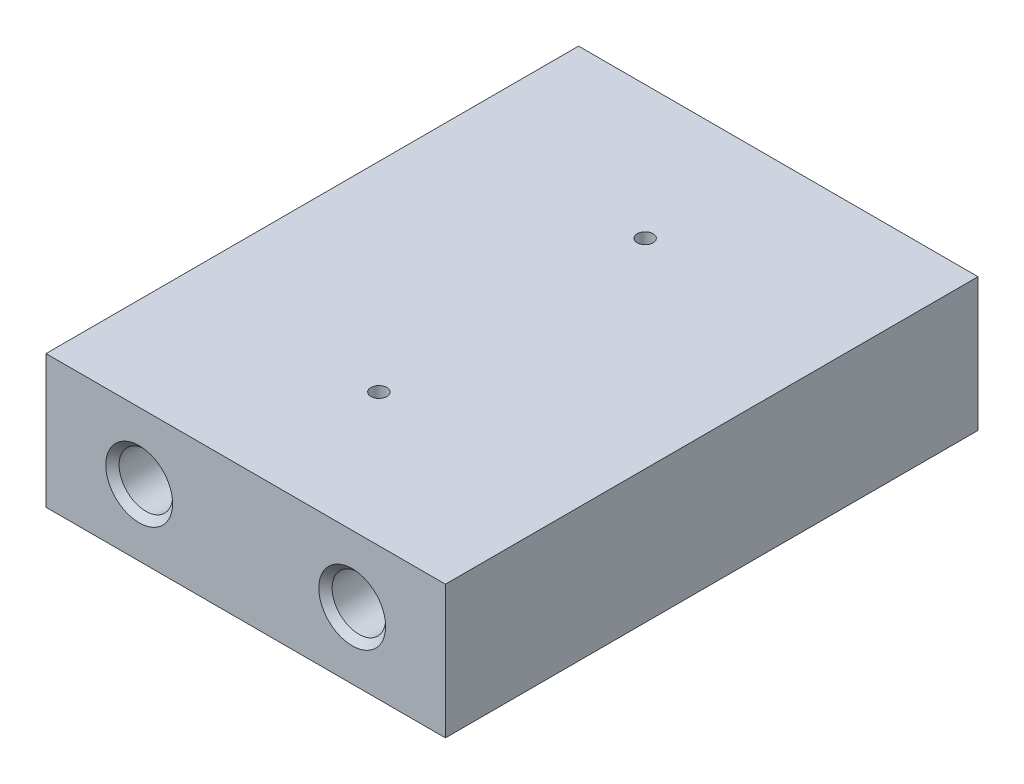
ISO-10303-21;
HEADER;
FILE_DESCRIPTION(('STEP AP214'),'2;1');
FILE_NAME('part.step','',(''),(''),'','','');
FILE_SCHEMA(('AUTOMOTIVE_DESIGN { 1 0 10303 214 1 1 1 1 }'));
ENDSEC;
DATA;
#1=APPLICATION_CONTEXT('core data for automotive mechanical design processes');
#2=APPLICATION_PROTOCOL_DEFINITION('international standard','automotive_design',2000,#1);
#3=PRODUCT_CONTEXT('',#1,'mechanical');
#4=PRODUCT('Part','Part','',(#3));
#5=PRODUCT_RELATED_PRODUCT_CATEGORY('part','',(#4));
#6=PRODUCT_DEFINITION_FORMATION('','',#4);
#7=PRODUCT_DEFINITION_CONTEXT('part definition',#1,'design');
#8=PRODUCT_DEFINITION('design','',#6,#7);
#9=PRODUCT_DEFINITION_SHAPE('','',#8);
#10=(LENGTH_UNIT() NAMED_UNIT(*) SI_UNIT(.MILLI.,.METRE.));
#11=(NAMED_UNIT(*) PLANE_ANGLE_UNIT() SI_UNIT($,.RADIAN.));
#12=(NAMED_UNIT(*) SI_UNIT($,.STERADIAN.) SOLID_ANGLE_UNIT());
#13=UNCERTAINTY_MEASURE_WITH_UNIT(LENGTH_MEASURE(1.E-05),#10,'distance_accuracy_value','');
#14=(GEOMETRIC_REPRESENTATION_CONTEXT(3) GLOBAL_UNCERTAINTY_ASSIGNED_CONTEXT((#13)) GLOBAL_UNIT_ASSIGNED_CONTEXT((#10,
#11,#12)) REPRESENTATION_CONTEXT('',''));
#15=CARTESIAN_POINT('',(0.,0.,0.));
#16=DIRECTION('',(0.,0.,1.));
#17=DIRECTION('',(1.,0.,0.));
#18=AXIS2_PLACEMENT_3D('',#15,#16,#17);
#19=CARTESIAN_POINT('',(19.05,-6.34999999999999,-50.8));
#20=DIRECTION('',(1.,0.,0.));
#21=DIRECTION('',(0.,0.,-1.));
#22=AXIS2_PLACEMENT_3D('',#19,#20,#21);
#23=PLANE('',#22);
#24=DIRECTION('',(0.,1.,0.));
#25=VECTOR('',#24,1.);
#26=CARTESIAN_POINT('',(19.05,-6.34999999999999,0.));
#27=LINE('',#26,#25);
#28=CARTESIAN_POINT('',(19.05,-6.34999999999999,0.));
#29=VERTEX_POINT('',#28);
#30=CARTESIAN_POINT('',(19.05,6.35000000000001,0.));
#31=VERTEX_POINT('',#30);
#32=EDGE_CURVE('E174',#29,#31,#27,.T.);
#33=ORIENTED_EDGE('',*,*,#32,.F.);
#34=DIRECTION('',(0.,0.,1.));
#35=VECTOR('',#34,1.);
#36=CARTESIAN_POINT('',(19.05,-6.34999999999999,-50.8));
#37=LINE('',#36,#35);
#38=CARTESIAN_POINT('',(19.05,-6.34999999999999,-50.8));
#39=VERTEX_POINT('',#38);
#40=EDGE_CURVE('E11',#39,#29,#37,.T.);
#41=ORIENTED_EDGE('',*,*,#40,.F.);
#42=DIRECTION('',(0.,1.,0.));
#43=VECTOR('',#42,1.);
#44=CARTESIAN_POINT('',(19.05,-6.34999999999999,-50.8));
#45=LINE('',#44,#43);
#46=CARTESIAN_POINT('',(19.05,6.35000000000001,-50.8));
#47=VERTEX_POINT('',#46);
#48=EDGE_CURVE('E175',#39,#47,#45,.T.);
#49=ORIENTED_EDGE('',*,*,#48,.T.);
#50=DIRECTION('',(0.,0.,1.));
#51=VECTOR('',#50,1.);
#52=CARTESIAN_POINT('',(19.05,6.35000000000001,-50.8));
#53=LINE('',#52,#51);
#54=EDGE_CURVE('E44',#47,#31,#53,.T.);
#55=ORIENTED_EDGE('',*,*,#54,.T.);
#56=EDGE_LOOP('',(#33,#41,#49,#55));
#57=FACE_BOUND('',#56,.T.);
#58=ADVANCED_FACE('F41',(#57),#23,.T.);
#59=CARTESIAN_POINT('',(-19.05,-6.34999999999999,-50.8));
#60=DIRECTION('',(0.,-1.,0.));
#61=DIRECTION('',(0.,0.,-1.));
#62=AXIS2_PLACEMENT_3D('',#59,#60,#61);
#63=PLANE('',#62);
#64=CARTESIAN_POINT('',(3.44169137633799E-12,-6.34999999999999,-38.1));
#65=DIRECTION('',(0.,1.,0.));
#66=DIRECTION('',(0.,0.,1.));
#67=AXIS2_PLACEMENT_3D('',#64,#65,#66);
#68=CIRCLE('',#67,0.755649999999997);
#69=CARTESIAN_POINT('',(3.44169137633799E-12,-6.34999999999999,-37.34435));
#70=VERTEX_POINT('',#69);
#71=EDGE_CURVE('E129',#70,#70,#68,.T.);
#72=ORIENTED_EDGE('',*,*,#71,.T.);
#73=EDGE_LOOP('',(#72));
#74=FACE_BOUND('',#73,.T.);
#75=CARTESIAN_POINT('',(3.44169137633799E-12,-6.34999999999999,-12.7));
#76=DIRECTION('',(0.,1.,0.));
#77=DIRECTION('',(0.,0.,1.));
#78=AXIS2_PLACEMENT_3D('',#75,#76,#77);
#79=CIRCLE('',#78,0.755649999999997);
#80=CARTESIAN_POINT('',(3.44169137633799E-12,-6.34999999999999,-11.94435));
#81=VERTEX_POINT('',#80);
#82=EDGE_CURVE('E135',#81,#81,#79,.T.);
#83=ORIENTED_EDGE('',*,*,#82,.T.);
#84=EDGE_LOOP('',(#83));
#85=FACE_BOUND('',#84,.T.);
#86=DIRECTION('',(1.,0.,0.));
#87=VECTOR('',#86,1.);
#88=CARTESIAN_POINT('',(-19.05,-6.34999999999999,0.));
#89=LINE('',#88,#87);
#90=CARTESIAN_POINT('',(-19.05,-6.34999999999999,0.));
#91=VERTEX_POINT('',#90);
#92=EDGE_CURVE('E178',#91,#29,#89,.T.);
#93=ORIENTED_EDGE('',*,*,#92,.F.);
#94=DIRECTION('',(0.,0.,1.));
#95=VECTOR('',#94,1.);
#96=CARTESIAN_POINT('',(-19.05,-6.34999999999999,-50.8));
#97=LINE('',#96,#95);
#98=CARTESIAN_POINT('',(-19.05,-6.34999999999999,-50.8));
#99=VERTEX_POINT('',#98);
#100=EDGE_CURVE('E50',#99,#91,#97,.T.);
#101=ORIENTED_EDGE('',*,*,#100,.F.);
#102=DIRECTION('',(1.,0.,0.));
#103=VECTOR('',#102,1.);
#104=CARTESIAN_POINT('',(-19.05,-6.34999999999999,-50.8));
#105=LINE('',#104,#103);
#106=EDGE_CURVE('E182',#99,#39,#105,.T.);
#107=ORIENTED_EDGE('',*,*,#106,.T.);
#108=ORIENTED_EDGE('',*,*,#40,.T.);
#109=EDGE_LOOP('',(#93,#101,#107,#108));
#110=FACE_BOUND('',#109,.T.);
#111=ADVANCED_FACE('F197',(#74,#85,#110),#63,.T.);
#112=CARTESIAN_POINT('',(-19.05,-6.34999999999999,-50.8));
#113=DIRECTION('',(-1.,0.,0.));
#114=DIRECTION('',(0.,0.,1.));
#115=AXIS2_PLACEMENT_3D('',#112,#113,#114);
#116=PLANE('',#115);
#117=CARTESIAN_POINT('',(-19.05,0.,-34.29));
#118=DIRECTION('',(-1.,0.,0.));
#119=DIRECTION('',(0.,0.,1.));
#120=AXIS2_PLACEMENT_3D('',#117,#118,#119);
#121=CIRCLE('',#120,1.5875);
#122=CARTESIAN_POINT('',(-19.05,0.,-32.7025));
#123=VERTEX_POINT('',#122);
#124=EDGE_CURVE('E116',#123,#123,#121,.T.);
#125=ORIENTED_EDGE('',*,*,#124,.F.);
#126=EDGE_LOOP('',(#125));
#127=FACE_BOUND('',#126,.T.);
#128=CARTESIAN_POINT('',(-19.05,0.,-16.51));
#129=DIRECTION('',(-1.,0.,0.));
#130=DIRECTION('',(0.,0.,1.));
#131=AXIS2_PLACEMENT_3D('',#128,#129,#130);
#132=CIRCLE('',#131,1.5875);
#133=CARTESIAN_POINT('',(-19.05,0.,-14.9225));
#134=VERTEX_POINT('',#133);
#135=EDGE_CURVE('E115',#134,#134,#132,.T.);
#136=ORIENTED_EDGE('',*,*,#135,.F.);
#137=EDGE_LOOP('',(#136));
#138=FACE_BOUND('',#137,.T.);
#139=DIRECTION('',(0.,-1.,0.));
#140=VECTOR('',#139,1.);
#141=CARTESIAN_POINT('',(-19.05,-6.34999999999999,0.));
#142=LINE('',#141,#140);
#143=CARTESIAN_POINT('',(-19.05,6.35000000000001,0.));
#144=VERTEX_POINT('',#143);
#145=EDGE_CURVE('E189',#144,#91,#142,.T.);
#146=ORIENTED_EDGE('',*,*,#145,.F.);
#147=DIRECTION('',(0.,0.,1.));
#148=VECTOR('',#147,1.);
#149=CARTESIAN_POINT('',(-19.05,6.35000000000001,-50.8));
#150=LINE('',#149,#148);
#151=CARTESIAN_POINT('',(-19.05,6.35000000000001,-50.8));
#152=VERTEX_POINT('',#151);
#153=EDGE_CURVE('E193',#152,#144,#150,.T.);
#154=ORIENTED_EDGE('',*,*,#153,.F.);
#155=DIRECTION('',(0.,-1.,0.));
#156=VECTOR('',#155,1.);
#157=CARTESIAN_POINT('',(-19.05,-6.34999999999999,-50.8));
#158=LINE('',#157,#156);
#159=EDGE_CURVE('E180',#152,#99,#158,.T.);
#160=ORIENTED_EDGE('',*,*,#159,.T.);
#161=ORIENTED_EDGE('',*,*,#100,.T.);
#162=EDGE_LOOP('',(#146,#154,#160,#161));
#163=FACE_BOUND('',#162,.T.);
#164=ADVANCED_FACE('F200',(#127,#138,#163),#116,.T.);
#165=CARTESIAN_POINT('',(-19.05,6.35000000000001,-50.8));
#166=DIRECTION('',(0.,1.,0.));
#167=DIRECTION('',(0.,0.,1.));
#168=AXIS2_PLACEMENT_3D('',#165,#166,#167);
#169=PLANE('',#168);
#170=CARTESIAN_POINT('',(3.44169137633799E-12,6.35000000000001,-38.1));
#171=DIRECTION('',(0.,1.,0.));
#172=DIRECTION('',(0.,0.,1.));
#173=AXIS2_PLACEMENT_3D('',#170,#171,#172);
#174=CIRCLE('',#173,0.755649999999998);
#175=CARTESIAN_POINT('',(3.44169137633799E-12,6.35000000000001,-37.34435));
#176=VERTEX_POINT('',#175);
#177=EDGE_CURVE('E126',#176,#176,#174,.T.);
#178=ORIENTED_EDGE('',*,*,#177,.F.);
#179=EDGE_LOOP('',(#178));
#180=FACE_BOUND('',#179,.T.);
#181=CARTESIAN_POINT('',(3.44169137633799E-12,6.35000000000001,-12.7));
#182=DIRECTION('',(0.,1.,0.));
#183=DIRECTION('',(0.,0.,1.));
#184=AXIS2_PLACEMENT_3D('',#181,#182,#183);
#185=CIRCLE('',#184,0.755649999999998);
#186=CARTESIAN_POINT('',(3.44169137633799E-12,6.35000000000001,-11.94435));
#187=VERTEX_POINT('',#186);
#188=EDGE_CURVE('E132',#187,#187,#185,.T.);
#189=ORIENTED_EDGE('',*,*,#188,.F.);
#190=EDGE_LOOP('',(#189));
#191=FACE_BOUND('',#190,.T.);
#192=DIRECTION('',(-1.,0.,0.));
#193=VECTOR('',#192,1.);
#194=CARTESIAN_POINT('',(-19.05,6.35000000000001,0.));
#195=LINE('',#194,#193);
#196=EDGE_CURVE('E186',#31,#144,#195,.T.);
#197=ORIENTED_EDGE('',*,*,#196,.F.);
#198=ORIENTED_EDGE('',*,*,#54,.F.);
#199=DIRECTION('',(-1.,0.,0.));
#200=VECTOR('',#199,1.);
#201=CARTESIAN_POINT('',(-19.05,6.35000000000001,-50.8));
#202=LINE('',#201,#200);
#203=EDGE_CURVE('E177',#47,#152,#202,.T.);
#204=ORIENTED_EDGE('',*,*,#203,.T.);
#205=ORIENTED_EDGE('',*,*,#153,.T.);
#206=EDGE_LOOP('',(#197,#198,#204,#205));
#207=FACE_BOUND('',#206,.T.);
#208=ADVANCED_FACE('F194',(#180,#191,#207),#169,.T.);
#209=CARTESIAN_POINT('',(0.,0.,-50.8));
#210=DIRECTION('',(0.,0.,-1.));
#211=DIRECTION('',(-1.,0.,0.));
#212=AXIS2_PLACEMENT_3D('',#209,#210,#211);
#213=PLANE('',#212);
#214=CARTESIAN_POINT('',(-10.1599999999965,0.,-50.8));
#215=DIRECTION('',(0.,0.,-1.));
#216=DIRECTION('',(-1.,0.,0.));
#217=AXIS2_PLACEMENT_3D('',#214,#215,#216);
#218=CIRCLE('',#217,3.1877);
#219=CARTESIAN_POINT('',(-13.3476999999965,0.,-50.8));
#220=VERTEX_POINT('',#219);
#221=EDGE_CURVE('E138',#220,#220,#218,.T.);
#222=ORIENTED_EDGE('',*,*,#221,.F.);
#223=EDGE_LOOP('',(#222));
#224=FACE_BOUND('',#223,.T.);
#225=CARTESIAN_POINT('',(10.1600000000035,0.,-50.8));
#226=DIRECTION('',(0.,0.,-1.));
#227=DIRECTION('',(-1.,0.,0.));
#228=AXIS2_PLACEMENT_3D('',#225,#226,#227);
#229=CIRCLE('',#228,3.1877);
#230=CARTESIAN_POINT('',(6.97230000000349,0.,-50.8));
#231=VERTEX_POINT('',#230);
#232=EDGE_CURVE('E147',#231,#231,#229,.T.);
#233=ORIENTED_EDGE('',*,*,#232,.F.);
#234=EDGE_LOOP('',(#233));
#235=FACE_BOUND('',#234,.T.);
#236=ORIENTED_EDGE('',*,*,#48,.F.);
#237=ORIENTED_EDGE('',*,*,#106,.F.);
#238=ORIENTED_EDGE('',*,*,#159,.F.);
#239=ORIENTED_EDGE('',*,*,#203,.F.);
#240=EDGE_LOOP('',(#236,#237,#238,#239));
#241=FACE_BOUND('',#240,.T.);
#242=ADVANCED_FACE('F202',(#224,#235,#241),#213,.T.);
#243=CARTESIAN_POINT('',(0.,0.,0.));
#244=DIRECTION('',(0.,0.,-1.));
#245=DIRECTION('',(-1.,0.,0.));
#246=AXIS2_PLACEMENT_3D('',#243,#244,#245);
#247=PLANE('',#246);
#248=CARTESIAN_POINT('',(-10.1599999999965,0.,0.));
#249=DIRECTION('',(0.,0.,1.));
#250=DIRECTION('',(1.,0.,0.));
#251=AXIS2_PLACEMENT_3D('',#248,#249,#250);
#252=CIRCLE('',#251,3.1877);
#253=CARTESIAN_POINT('',(-6.97229999999651,0.,0.));
#254=VERTEX_POINT('',#253);
#255=EDGE_CURVE('E156',#254,#254,#252,.T.);
#256=ORIENTED_EDGE('',*,*,#255,.F.);
#257=EDGE_LOOP('',(#256));
#258=FACE_BOUND('',#257,.T.);
#259=CARTESIAN_POINT('',(10.1600000000035,0.,0.));
#260=DIRECTION('',(0.,0.,1.));
#261=DIRECTION('',(1.,0.,0.));
#262=AXIS2_PLACEMENT_3D('',#259,#260,#261);
#263=CIRCLE('',#262,3.1877);
#264=CARTESIAN_POINT('',(13.3477000000035,0.,0.));
#265=VERTEX_POINT('',#264);
#266=EDGE_CURVE('E165',#265,#265,#263,.T.);
#267=ORIENTED_EDGE('',*,*,#266,.F.);
#268=EDGE_LOOP('',(#267));
#269=FACE_BOUND('',#268,.T.);
#270=ORIENTED_EDGE('',*,*,#32,.T.);
#271=ORIENTED_EDGE('',*,*,#196,.T.);
#272=ORIENTED_EDGE('',*,*,#145,.T.);
#273=ORIENTED_EDGE('',*,*,#92,.T.);
#274=EDGE_LOOP('',(#270,#271,#272,#273));
#275=FACE_BOUND('',#274,.T.);
#276=ADVANCED_FACE('F196',(#258,#269,#275),#247,.F.);
#277=CARTESIAN_POINT('',(10.1600000000035,0.,-12.7));
#278=DIRECTION('',(0.,0.,1.));
#279=DIRECTION('',(1.,0.,0.));
#280=AXIS2_PLACEMENT_3D('',#277,#278,#279);
#281=CONICAL_SURFACE('',#280,2.5527,1.02974425867665);
#282=CARTESIAN_POINT('',(10.1600000000035,0.,-14.2338169021917));
#283=VERTEX_POINT('',#282);
#284=VERTEX_LOOP('',#283);
#285=FACE_BOUND('',#284,.T.);
#286=CARTESIAN_POINT('',(10.1600000000035,0.,-12.7));
#287=DIRECTION('',(0.,0.,1.));
#288=DIRECTION('',(1.,0.,0.));
#289=AXIS2_PLACEMENT_3D('',#286,#287,#288);
#290=CIRCLE('',#289,2.5527);
#291=CARTESIAN_POINT('',(12.7127000000035,0.,-12.7));
#292=VERTEX_POINT('',#291);
#293=EDGE_CURVE('E171',#292,#292,#290,.T.);
#294=ORIENTED_EDGE('',*,*,#293,.T.);
#295=EDGE_LOOP('',(#294));
#296=FACE_BOUND('',#295,.T.);
#297=ADVANCED_FACE('F210',(#285,#296),#281,.F.);
#298=CARTESIAN_POINT('',(10.1600000000035,0.,0.));
#299=DIRECTION('',(0.,0.,1.));
#300=DIRECTION('',(1.,0.,0.));
#301=AXIS2_PLACEMENT_3D('',#298,#299,#300);
#302=CYLINDRICAL_SURFACE('',#301,2.5527);
#303=ORIENTED_EDGE('',*,*,#293,.F.);
#304=EDGE_LOOP('',(#303));
#305=FACE_BOUND('',#304,.T.);
#306=CARTESIAN_POINT('',(10.1600000000035,0.,-0.635000000000004));
#307=DIRECTION('',(0.,0.,1.));
#308=DIRECTION('',(1.,0.,0.));
#309=AXIS2_PLACEMENT_3D('',#306,#307,#308);
#310=CIRCLE('',#309,2.5527);
#311=CARTESIAN_POINT('',(12.7127000000035,0.,-0.635000000000004));
#312=VERTEX_POINT('',#311);
#313=EDGE_CURVE('E168',#312,#312,#310,.T.);
#314=ORIENTED_EDGE('',*,*,#313,.T.);
#315=EDGE_LOOP('',(#314));
#316=FACE_BOUND('',#315,.T.);
#317=ADVANCED_FACE('F286',(#305,#316),#302,.F.);
#318=CARTESIAN_POINT('',(10.1600000000035,0.,0.));
#319=DIRECTION('',(0.,0.,1.));
#320=DIRECTION('',(1.,0.,0.));
#321=AXIS2_PLACEMENT_3D('',#318,#319,#320);
#322=CONICAL_SURFACE('',#321,3.1877,0.785398163397446);
#323=ORIENTED_EDGE('',*,*,#313,.F.);
#324=EDGE_LOOP('',(#323));
#325=FACE_BOUND('',#324,.T.);
#326=ORIENTED_EDGE('',*,*,#266,.T.);
#327=EDGE_LOOP('',(#326));
#328=FACE_BOUND('',#327,.T.);
#329=ADVANCED_FACE('F282',(#325,#328),#322,.F.);
#330=CARTESIAN_POINT('',(-10.1599999999965,0.,-12.7));
#331=DIRECTION('',(0.,0.,1.));
#332=DIRECTION('',(1.,0.,0.));
#333=AXIS2_PLACEMENT_3D('',#330,#331,#332);
#334=CONICAL_SURFACE('',#333,2.5527,1.02974425867665);
#335=CARTESIAN_POINT('',(-10.1599999999965,0.,-14.2338169021917));
#336=VERTEX_POINT('',#335);
#337=VERTEX_LOOP('',#336);
#338=FACE_BOUND('',#337,.T.);
#339=CARTESIAN_POINT('',(-10.1599999999965,0.,-12.7));
#340=DIRECTION('',(0.,0.,1.));
#341=DIRECTION('',(1.,0.,0.));
#342=AXIS2_PLACEMENT_3D('',#339,#340,#341);
#343=CIRCLE('',#342,2.5527);
#344=CARTESIAN_POINT('',(-7.60729999999651,0.,-12.7));
#345=VERTEX_POINT('',#344);
#346=EDGE_CURVE('E162',#345,#345,#343,.T.);
#347=ORIENTED_EDGE('',*,*,#346,.T.);
#348=EDGE_LOOP('',(#347));
#349=FACE_BOUND('',#348,.T.);
#350=ADVANCED_FACE('F278',(#338,#349),#334,.F.);
#351=CARTESIAN_POINT('',(-10.1599999999965,0.,0.));
#352=DIRECTION('',(0.,0.,1.));
#353=DIRECTION('',(1.,0.,0.));
#354=AXIS2_PLACEMENT_3D('',#351,#352,#353);
#355=CYLINDRICAL_SURFACE('',#354,2.5527);
#356=ORIENTED_EDGE('',*,*,#346,.F.);
#357=EDGE_LOOP('',(#356));
#358=FACE_BOUND('',#357,.T.);
#359=CARTESIAN_POINT('',(-10.1599999999965,0.,-0.635000000000004));
#360=DIRECTION('',(0.,0.,1.));
#361=DIRECTION('',(1.,0.,0.));
#362=AXIS2_PLACEMENT_3D('',#359,#360,#361);
#363=CIRCLE('',#362,2.5527);
#364=CARTESIAN_POINT('',(-7.60729999999651,0.,-0.635000000000004));
#365=VERTEX_POINT('',#364);
#366=EDGE_CURVE('E159',#365,#365,#363,.T.);
#367=ORIENTED_EDGE('',*,*,#366,.T.);
#368=EDGE_LOOP('',(#367));
#369=FACE_BOUND('',#368,.T.);
#370=ADVANCED_FACE('F274',(#358,#369),#355,.F.);
#371=CARTESIAN_POINT('',(-10.1599999999965,0.,0.));
#372=DIRECTION('',(0.,0.,1.));
#373=DIRECTION('',(1.,0.,0.));
#374=AXIS2_PLACEMENT_3D('',#371,#372,#373);
#375=CONICAL_SURFACE('',#374,3.1877,0.785398163397446);
#376=ORIENTED_EDGE('',*,*,#366,.F.);
#377=EDGE_LOOP('',(#376));
#378=FACE_BOUND('',#377,.T.);
#379=ORIENTED_EDGE('',*,*,#255,.T.);
#380=EDGE_LOOP('',(#379));
#381=FACE_BOUND('',#380,.T.);
#382=ADVANCED_FACE('F270',(#378,#381),#375,.F.);
#383=CARTESIAN_POINT('',(10.1600000000035,0.,-38.1));
#384=DIRECTION('',(0.,0.,-1.));
#385=DIRECTION('',(-1.,0.,0.));
#386=AXIS2_PLACEMENT_3D('',#383,#384,#385);
#387=CONICAL_SURFACE('',#386,2.5527,1.02974425867665);
#388=CARTESIAN_POINT('',(10.1600000000035,0.,-36.5661830978083));
#389=VERTEX_POINT('',#388);
#390=VERTEX_LOOP('',#389);
#391=FACE_BOUND('',#390,.T.);
#392=CARTESIAN_POINT('',(10.1600000000035,0.,-38.1));
#393=DIRECTION('',(0.,0.,-1.));
#394=DIRECTION('',(-1.,0.,0.));
#395=AXIS2_PLACEMENT_3D('',#392,#393,#394);
#396=CIRCLE('',#395,2.5527);
#397=CARTESIAN_POINT('',(7.60730000000349,0.,-38.1));
#398=VERTEX_POINT('',#397);
#399=EDGE_CURVE('E153',#398,#398,#396,.T.);
#400=ORIENTED_EDGE('',*,*,#399,.T.);
#401=EDGE_LOOP('',(#400));
#402=FACE_BOUND('',#401,.T.);
#403=ADVANCED_FACE('F266',(#391,#402),#387,.F.);
#404=CARTESIAN_POINT('',(10.1600000000035,0.,-50.8));
#405=DIRECTION('',(0.,0.,-1.));
#406=DIRECTION('',(-1.,0.,0.));
#407=AXIS2_PLACEMENT_3D('',#404,#405,#406);
#408=CYLINDRICAL_SURFACE('',#407,2.5527);
#409=ORIENTED_EDGE('',*,*,#399,.F.);
#410=EDGE_LOOP('',(#409));
#411=FACE_BOUND('',#410,.T.);
#412=CARTESIAN_POINT('',(10.1600000000035,0.,-50.165));
#413=DIRECTION('',(0.,0.,-1.));
#414=DIRECTION('',(-1.,0.,0.));
#415=AXIS2_PLACEMENT_3D('',#412,#413,#414);
#416=CIRCLE('',#415,2.5527);
#417=CARTESIAN_POINT('',(7.60730000000349,0.,-50.165));
#418=VERTEX_POINT('',#417);
#419=EDGE_CURVE('E150',#418,#418,#416,.T.);
#420=ORIENTED_EDGE('',*,*,#419,.T.);
#421=EDGE_LOOP('',(#420));
#422=FACE_BOUND('',#421,.T.);
#423=ADVANCED_FACE('F262',(#411,#422),#408,.F.);
#424=CARTESIAN_POINT('',(10.1600000000035,0.,-50.8));
#425=DIRECTION('',(0.,0.,-1.));
#426=DIRECTION('',(-1.,0.,0.));
#427=AXIS2_PLACEMENT_3D('',#424,#425,#426);
#428=CONICAL_SURFACE('',#427,3.1877,0.785398163397447);
#429=ORIENTED_EDGE('',*,*,#419,.F.);
#430=EDGE_LOOP('',(#429));
#431=FACE_BOUND('',#430,.T.);
#432=ORIENTED_EDGE('',*,*,#232,.T.);
#433=EDGE_LOOP('',(#432));
#434=FACE_BOUND('',#433,.T.);
#435=ADVANCED_FACE('F258',(#431,#434),#428,.F.);
#436=CARTESIAN_POINT('',(-10.1599999999965,0.,-38.1));
#437=DIRECTION('',(0.,0.,-1.));
#438=DIRECTION('',(-1.,0.,0.));
#439=AXIS2_PLACEMENT_3D('',#436,#437,#438);
#440=CONICAL_SURFACE('',#439,2.5527,1.02974425867665);
#441=CARTESIAN_POINT('',(-10.1599999999965,0.,-36.5661830978083));
#442=VERTEX_POINT('',#441);
#443=VERTEX_LOOP('',#442);
#444=FACE_BOUND('',#443,.T.);
#445=CARTESIAN_POINT('',(-10.1599999999965,0.,-38.1));
#446=DIRECTION('',(0.,0.,-1.));
#447=DIRECTION('',(-1.,0.,0.));
#448=AXIS2_PLACEMENT_3D('',#445,#446,#447);
#449=CIRCLE('',#448,2.5527);
#450=CARTESIAN_POINT('',(-12.7126999999965,0.,-38.1));
#451=VERTEX_POINT('',#450);
#452=EDGE_CURVE('E144',#451,#451,#449,.T.);
#453=ORIENTED_EDGE('',*,*,#452,.T.);
#454=EDGE_LOOP('',(#453));
#455=FACE_BOUND('',#454,.T.);
#456=ADVANCED_FACE('F254',(#444,#455),#440,.F.);
#457=CARTESIAN_POINT('',(-10.1599999999965,0.,-50.8));
#458=DIRECTION('',(0.,0.,-1.));
#459=DIRECTION('',(-1.,0.,0.));
#460=AXIS2_PLACEMENT_3D('',#457,#458,#459);
#461=CYLINDRICAL_SURFACE('',#460,2.5527);
#462=ORIENTED_EDGE('',*,*,#452,.F.);
#463=EDGE_LOOP('',(#462));
#464=FACE_BOUND('',#463,.T.);
#465=CARTESIAN_POINT('',(-10.1599999999965,0.,-50.165));
#466=DIRECTION('',(0.,0.,-1.));
#467=DIRECTION('',(-1.,0.,0.));
#468=AXIS2_PLACEMENT_3D('',#465,#466,#467);
#469=CIRCLE('',#468,2.5527);
#470=CARTESIAN_POINT('',(-12.7126999999965,0.,-50.165));
#471=VERTEX_POINT('',#470);
#472=EDGE_CURVE('E141',#471,#471,#469,.T.);
#473=ORIENTED_EDGE('',*,*,#472,.T.);
#474=EDGE_LOOP('',(#473));
#475=FACE_BOUND('',#474,.T.);
#476=ADVANCED_FACE('F247',(#464,#475),#461,.F.);
#477=CARTESIAN_POINT('',(-10.1599999999965,0.,-50.8));
#478=DIRECTION('',(0.,0.,-1.));
#479=DIRECTION('',(-1.,0.,0.));
#480=AXIS2_PLACEMENT_3D('',#477,#478,#479);
#481=CONICAL_SURFACE('',#480,3.1877,0.785398163397447);
#482=ORIENTED_EDGE('',*,*,#472,.F.);
#483=EDGE_LOOP('',(#482));
#484=FACE_BOUND('',#483,.T.);
#485=ORIENTED_EDGE('',*,*,#221,.T.);
#486=EDGE_LOOP('',(#485));
#487=FACE_BOUND('',#486,.T.);
#488=ADVANCED_FACE('F236',(#484,#487),#481,.F.);
#489=CARTESIAN_POINT('',(3.44169137633799E-12,6.35000000000001,-12.7));
#490=DIRECTION('',(0.,1.,0.));
#491=DIRECTION('',(0.,0.,1.));
#492=AXIS2_PLACEMENT_3D('',#489,#490,#491);
#493=CYLINDRICAL_SURFACE('',#492,0.755649999999998);
#494=ORIENTED_EDGE('',*,*,#82,.F.);
#495=EDGE_LOOP('',(#494));
#496=FACE_BOUND('',#495,.T.);
#497=ORIENTED_EDGE('',*,*,#188,.T.);
#498=EDGE_LOOP('',(#497));
#499=FACE_BOUND('',#498,.T.);
#500=ADVANCED_FACE('F232',(#496,#499),#493,.F.);
#501=CARTESIAN_POINT('',(3.44169137633799E-12,6.35000000000001,-38.1));
#502=DIRECTION('',(0.,1.,0.));
#503=DIRECTION('',(0.,0.,1.));
#504=AXIS2_PLACEMENT_3D('',#501,#502,#503);
#505=CYLINDRICAL_SURFACE('',#504,0.755649999999998);
#506=ORIENTED_EDGE('',*,*,#71,.F.);
#507=EDGE_LOOP('',(#506));
#508=FACE_BOUND('',#507,.T.);
#509=ORIENTED_EDGE('',*,*,#177,.T.);
#510=EDGE_LOOP('',(#509));
#511=FACE_BOUND('',#510,.T.);
#512=ADVANCED_FACE('F235',(#508,#511),#505,.F.);
#513=CARTESIAN_POINT('',(-13.97,0.,-16.51));
#514=DIRECTION('',(-1.,0.,0.));
#515=DIRECTION('',(0.,0.,1.));
#516=AXIS2_PLACEMENT_3D('',#513,#514,#515);
#517=CONICAL_SURFACE('',#516,1.5875,1.02974425867665);
#518=CARTESIAN_POINT('',(-13.0161337672937,0.,-16.51));
#519=VERTEX_POINT('',#518);
#520=VERTEX_LOOP('',#519);
#521=FACE_BOUND('',#520,.T.);
#522=CARTESIAN_POINT('',(-13.97,0.,-16.51));
#523=DIRECTION('',(-1.,0.,0.));
#524=DIRECTION('',(0.,0.,1.));
#525=AXIS2_PLACEMENT_3D('',#522,#523,#524);
#526=CIRCLE('',#525,1.5875);
#527=CARTESIAN_POINT('',(-13.97,0.,-14.9225));
#528=VERTEX_POINT('',#527);
#529=EDGE_CURVE('E119',#528,#528,#526,.T.);
#530=ORIENTED_EDGE('',*,*,#529,.T.);
#531=EDGE_LOOP('',(#530));
#532=FACE_BOUND('',#531,.T.);
#533=ADVANCED_FACE('F244',(#521,#532),#517,.F.);
#534=CARTESIAN_POINT('',(-19.05,0.,-16.51));
#535=DIRECTION('',(-1.,0.,0.));
#536=DIRECTION('',(0.,0.,1.));
#537=AXIS2_PLACEMENT_3D('',#534,#535,#536);
#538=CYLINDRICAL_SURFACE('',#537,1.5875);
#539=ORIENTED_EDGE('',*,*,#529,.F.);
#540=EDGE_LOOP('',(#539));
#541=FACE_BOUND('',#540,.T.);
#542=ORIENTED_EDGE('',*,*,#135,.T.);
#543=EDGE_LOOP('',(#542));
#544=FACE_BOUND('',#543,.T.);
#545=ADVANCED_FACE('F109',(#541,#544),#538,.F.);
#546=CARTESIAN_POINT('',(-13.97,0.,-34.29));
#547=DIRECTION('',(-1.,0.,0.));
#548=DIRECTION('',(0.,0.,1.));
#549=AXIS2_PLACEMENT_3D('',#546,#547,#548);
#550=CONICAL_SURFACE('',#549,1.5875,1.02974425867665);
#551=CARTESIAN_POINT('',(-13.0161337672937,0.,-34.29));
#552=VERTEX_POINT('',#551);
#553=VERTEX_LOOP('',#552);
#554=FACE_BOUND('',#553,.T.);
#555=CARTESIAN_POINT('',(-13.97,0.,-34.29));
#556=DIRECTION('',(-1.,0.,0.));
#557=DIRECTION('',(0.,0.,1.));
#558=AXIS2_PLACEMENT_3D('',#555,#556,#557);
#559=CIRCLE('',#558,1.5875);
#560=CARTESIAN_POINT('',(-13.97,0.,-32.7025));
#561=VERTEX_POINT('',#560);
#562=EDGE_CURVE('E113',#561,#561,#559,.T.);
#563=ORIENTED_EDGE('',*,*,#562,.T.);
#564=EDGE_LOOP('',(#563));
#565=FACE_BOUND('',#564,.T.);
#566=ADVANCED_FACE('F105',(#554,#565),#550,.F.);
#567=CARTESIAN_POINT('',(-19.05,0.,-34.29));
#568=DIRECTION('',(-1.,0.,0.));
#569=DIRECTION('',(0.,0.,1.));
#570=AXIS2_PLACEMENT_3D('',#567,#568,#569);
#571=CYLINDRICAL_SURFACE('',#570,1.5875);
#572=ORIENTED_EDGE('',*,*,#562,.F.);
#573=EDGE_LOOP('',(#572));
#574=FACE_BOUND('',#573,.T.);
#575=ORIENTED_EDGE('',*,*,#124,.T.);
#576=EDGE_LOOP('',(#575));
#577=FACE_BOUND('',#576,.T.);
#578=ADVANCED_FACE('F108',(#574,#577),#571,.F.);
#579=CLOSED_SHELL('',(#58,#111,#164,#208,#242,#276,#297,#317,#329,#350,#370,#382,#403,#423,#435,
#456,#476,#488,#500,#512,#533,#545,#566,#578));
#580=MANIFOLD_SOLID_BREP('B2',#579);
#581=ADVANCED_BREP_SHAPE_REPRESENTATION('',(#18,#580),#14);
#582=SHAPE_DEFINITION_REPRESENTATION(#9,#581);
ENDSEC;
END-ISO-10303-21;
